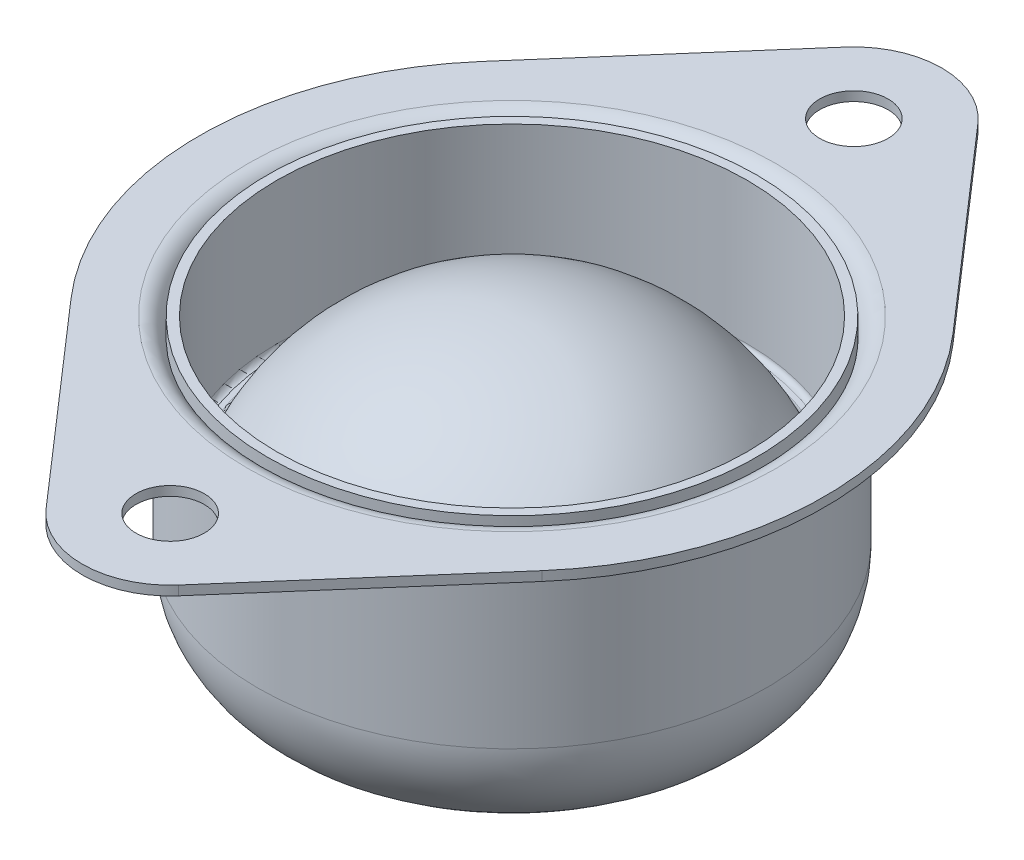
ISO-10303-21;
HEADER;
FILE_DESCRIPTION(('STEP AP214'),'2;1');
FILE_NAME('part.step','',(''),(''),'','','');
FILE_SCHEMA(('AUTOMOTIVE_DESIGN { 1 0 10303 214 1 1 1 1 }'));
ENDSEC;
DATA;
#1=APPLICATION_CONTEXT('core data for automotive mechanical design processes');
#2=APPLICATION_PROTOCOL_DEFINITION('international standard','automotive_design',2000,#1);
#3=PRODUCT_CONTEXT('',#1,'mechanical');
#4=PRODUCT('Part','Part','',(#3));
#5=PRODUCT_RELATED_PRODUCT_CATEGORY('part','',(#4));
#6=PRODUCT_DEFINITION_FORMATION('','',#4);
#7=PRODUCT_DEFINITION_CONTEXT('part definition',#1,'design');
#8=PRODUCT_DEFINITION('design','',#6,#7);
#9=PRODUCT_DEFINITION_SHAPE('','',#8);
#10=(LENGTH_UNIT() NAMED_UNIT(*) SI_UNIT(.MILLI.,.METRE.));
#11=(NAMED_UNIT(*) PLANE_ANGLE_UNIT() SI_UNIT($,.RADIAN.));
#12=(NAMED_UNIT(*) SI_UNIT($,.STERADIAN.) SOLID_ANGLE_UNIT());
#13=UNCERTAINTY_MEASURE_WITH_UNIT(LENGTH_MEASURE(1.E-05),#10,'distance_accuracy_value','');
#14=(GEOMETRIC_REPRESENTATION_CONTEXT(3) GLOBAL_UNCERTAINTY_ASSIGNED_CONTEXT((#13)) GLOBAL_UNIT_ASSIGNED_CONTEXT((#10,
#11,#12)) REPRESENTATION_CONTEXT('',''));
#15=CARTESIAN_POINT('',(0.,0.,0.));
#16=DIRECTION('',(0.,0.,1.));
#17=DIRECTION('',(1.,0.,0.));
#18=AXIS2_PLACEMENT_3D('',#15,#16,#17);
#19=CARTESIAN_POINT('',(0.,-16.7005,0.));
#20=DIRECTION('',(0.,-1.,0.));
#21=DIRECTION('',(0.,0.,1.));
#22=AXIS2_PLACEMENT_3D('',#19,#20,#21);
#23=SPHERICAL_SURFACE('',#22,12.7);
#24=CARTESIAN_POINT('',(0.,-29.4005,0.));
#25=VERTEX_POINT('',#24);
#26=VERTEX_LOOP('',#25);
#27=FACE_BOUND('',#26,.T.);
#28=ADVANCED_FACE('F39',(#27),#23,.T.);
#29=CLOSED_SHELL('',(#28));
#30=MANIFOLD_SOLID_BREP('B2',#29);
#31=CARTESIAN_POINT('',(0.,-11.938,0.));
#32=DIRECTION('',(0.,1.,0.));
#33=DIRECTION('',(0.,0.,1.));
#34=AXIS2_PLACEMENT_3D('',#31,#32,#33);
#35=CYLINDRICAL_SURFACE('',#34,19.8755);
#36=CARTESIAN_POINT('',(0.,-10.747375,0.));
#37=DIRECTION('',(0.,1.,0.));
#38=DIRECTION('',(0.,0.,1.));
#39=AXIS2_PLACEMENT_3D('',#36,#37,#38);
#40=CIRCLE('',#39,19.8755);
#41=CARTESIAN_POINT('',(0.,-10.747375,19.8755));
#42=VERTEX_POINT('',#41);
#43=EDGE_CURVE('E76',#42,#42,#40,.T.);
#44=ORIENTED_EDGE('',*,*,#43,.T.);
#45=EDGE_LOOP('',(#44));
#46=FACE_BOUND('',#45,.T.);
#47=CARTESIAN_POINT('',(0.,0.762,0.));
#48=DIRECTION('',(0.,1.,0.));
#49=DIRECTION('',(0.,0.,1.));
#50=AXIS2_PLACEMENT_3D('',#47,#48,#49);
#51=CIRCLE('',#50,19.8755);
#52=CARTESIAN_POINT('',(0.,0.762,19.8755));
#53=VERTEX_POINT('',#52);
#54=EDGE_CURVE('E81',#53,#53,#51,.T.);
#55=ORIENTED_EDGE('',*,*,#54,.F.);
#56=EDGE_LOOP('',(#55));
#57=FACE_BOUND('',#56,.T.);
#58=ADVANCED_FACE('F61',(#46,#57),#35,.T.);
#59=CARTESIAN_POINT('',(0.,-11.938,0.));
#60=DIRECTION('',(0.,1.,0.));
#61=DIRECTION('',(0.,0.,1.));
#62=AXIS2_PLACEMENT_3D('',#59,#60,#61);
#63=PLANE('',#62);
#64=CARTESIAN_POINT('',(0.,-11.938,0.));
#65=DIRECTION('',(0.,1.,0.));
#66=DIRECTION('',(0.,0.,1.));
#67=AXIS2_PLACEMENT_3D('',#64,#65,#66);
#68=CIRCLE('',#67,18.684875);
#69=CARTESIAN_POINT('',(0.,-11.938,18.684875));
#70=VERTEX_POINT('',#69);
#71=EDGE_CURVE('E68',#70,#70,#68,.F.);
#72=ORIENTED_EDGE('',*,*,#71,.T.);
#73=EDGE_LOOP('',(#72));
#74=FACE_BOUND('',#73,.T.);
#75=CARTESIAN_POINT('',(0.,-11.938,0.));
#76=DIRECTION('',(0.,1.,0.));
#77=DIRECTION('',(0.,0.,1.));
#78=AXIS2_PLACEMENT_3D('',#75,#76,#77);
#79=CIRCLE('',#78,18.2583205347589);
#80=CARTESIAN_POINT('',(0.,-11.938,18.2583205347589));
#81=VERTEX_POINT('',#80);
#82=EDGE_CURVE('E72',#81,#81,#79,.T.);
#83=ORIENTED_EDGE('',*,*,#82,.T.);
#84=EDGE_LOOP('',(#83));
#85=FACE_BOUND('',#84,.T.);
#86=ADVANCED_FACE('F113',(#74,#85),#63,.F.);
#87=CARTESIAN_POINT('',(0.,0.762,0.));
#88=DIRECTION('',(0.,1.,0.));
#89=DIRECTION('',(0.,0.,1.));
#90=AXIS2_PLACEMENT_3D('',#87,#88,#89);
#91=PLANE('',#90);
#92=CARTESIAN_POINT('',(0.,0.762000000000001,0.));
#93=DIRECTION('',(0.,1.,0.));
#94=DIRECTION('',(0.,0.,1.));
#95=AXIS2_PLACEMENT_3D('',#92,#93,#94);
#96=CIRCLE('',#95,19.1135);
#97=CARTESIAN_POINT('',(0.,0.762000000000001,19.1135));
#98=VERTEX_POINT('',#97);
#99=EDGE_CURVE('E85',#98,#98,#96,.T.);
#100=ORIENTED_EDGE('',*,*,#99,.F.);
#101=EDGE_LOOP('',(#100));
#102=FACE_BOUND('',#101,.T.);
#103=ORIENTED_EDGE('',*,*,#54,.T.);
#104=EDGE_LOOP('',(#103));
#105=FACE_BOUND('',#104,.T.);
#106=ADVANCED_FACE('F109',(#102,#105),#91,.T.);
#107=CARTESIAN_POINT('',(0.,-18.7407752659574,0.));
#108=DIRECTION('',(0.,-1.,0.));
#109=DIRECTION('',(0.,0.,1.));
#110=AXIS2_PLACEMENT_3D('',#107,#108,#109);
#111=SPHERICAL_SURFACE('',#110,18.7407752659574);
#112=CARTESIAN_POINT('',(0.,-11.2248699107771,0.));
#113=DIRECTION('',(0.,-1.,0.));
#114=DIRECTION('',(0.,0.,-1.));
#115=AXIS2_PLACEMENT_3D('',#112,#113,#114);
#116=CIRCLE('',#115,17.1676388668067);
#117=CARTESIAN_POINT('',(0.,-11.2248699107771,-17.1676388668067));
#118=VERTEX_POINT('',#117);
#119=EDGE_CURVE('E38',#118,#118,#116,.T.);
#120=ORIENTED_EDGE('',*,*,#119,.T.);
#121=EDGE_LOOP('',(#120));
#122=FACE_BOUND('',#121,.T.);
#123=ADVANCED_FACE('F112',(#122),#111,.F.);
#124=CARTESIAN_POINT('',(0.,-10.747375,0.));
#125=DIRECTION('',(0.,1.,0.));
#126=DIRECTION('',(0.,0.,1.));
#127=AXIS2_PLACEMENT_3D('',#124,#125,#126);
#128=TOROIDAL_SURFACE('',#127,18.684875,1.190625);
#129=ORIENTED_EDGE('',*,*,#71,.F.);
#130=EDGE_LOOP('',(#129));
#131=FACE_BOUND('',#130,.T.);
#132=ORIENTED_EDGE('',*,*,#43,.F.);
#133=EDGE_LOOP('',(#132));
#134=FACE_BOUND('',#133,.T.);
#135=ADVANCED_FACE('F124',(#131,#134),#128,.T.);
#136=CARTESIAN_POINT('',(0.,-10.747375,0.));
#137=DIRECTION('',(0.,1.,0.));
#138=DIRECTION('',(0.,0.,1.));
#139=AXIS2_PLACEMENT_3D('',#136,#137,#138);
#140=TOROIDAL_SURFACE('',#139,18.2583205347589,1.190625);
#141=ORIENTED_EDGE('',*,*,#82,.F.);
#142=EDGE_LOOP('',(#141));
#143=FACE_BOUND('',#142,.T.);
#144=ORIENTED_EDGE('',*,*,#119,.F.);
#145=EDGE_LOOP('',(#144));
#146=FACE_BOUND('',#145,.T.);
#147=ADVANCED_FACE('F63',(#143,#146),#140,.T.);
#148=CARTESIAN_POINT('',(0.,-11.938,0.));
#149=DIRECTION('',(0.,1.,0.));
#150=DIRECTION('',(0.,0.,1.));
#151=AXIS2_PLACEMENT_3D('',#148,#149,#150);
#152=CYLINDRICAL_SURFACE('',#151,19.1135);
#153=CARTESIAN_POINT('',(0.,-10.747375,0.));
#154=DIRECTION('',(0.,1.,0.));
#155=DIRECTION('',(0.,0.,1.));
#156=AXIS2_PLACEMENT_3D('',#153,#154,#155);
#157=CIRCLE('',#156,19.1135);
#158=CARTESIAN_POINT('',(0.,-10.747375,19.1135));
#159=VERTEX_POINT('',#158);
#160=EDGE_CURVE('E88',#159,#159,#157,.T.);
#161=ORIENTED_EDGE('',*,*,#160,.F.);
#162=EDGE_LOOP('',(#161));
#163=FACE_BOUND('',#162,.T.);
#164=ORIENTED_EDGE('',*,*,#99,.T.);
#165=EDGE_LOOP('',(#164));
#166=FACE_BOUND('',#165,.T.);
#167=ADVANCED_FACE('F102',(#163,#166),#152,.F.);
#168=CARTESIAN_POINT('',(0.,-11.176,0.));
#169=DIRECTION('',(0.,1.,0.));
#170=DIRECTION('',(0.,0.,1.));
#171=AXIS2_PLACEMENT_3D('',#168,#169,#170);
#172=PLANE('',#171);
#173=CARTESIAN_POINT('',(0.,-11.176,0.));
#174=DIRECTION('',(0.,1.,0.));
#175=DIRECTION('',(0.,0.,1.));
#176=AXIS2_PLACEMENT_3D('',#173,#174,#175);
#177=CIRCLE('',#176,18.684875);
#178=CARTESIAN_POINT('',(0.,-11.176,18.684875));
#179=VERTEX_POINT('',#178);
#180=EDGE_CURVE('E91',#179,#179,#177,.F.);
#181=ORIENTED_EDGE('',*,*,#180,.F.);
#182=EDGE_LOOP('',(#181));
#183=FACE_BOUND('',#182,.T.);
#184=CARTESIAN_POINT('',(0.,-11.176,0.));
#185=DIRECTION('',(0.,1.,0.));
#186=DIRECTION('',(0.,0.,1.));
#187=AXIS2_PLACEMENT_3D('',#184,#185,#186);
#188=CIRCLE('',#187,18.2583205347589);
#189=CARTESIAN_POINT('',(0.,-11.176,18.2583205347589));
#190=VERTEX_POINT('',#189);
#191=EDGE_CURVE('E92',#190,#190,#188,.T.);
#192=ORIENTED_EDGE('',*,*,#191,.F.);
#193=EDGE_LOOP('',(#192));
#194=FACE_BOUND('',#193,.T.);
#195=ADVANCED_FACE('F105',(#183,#194),#172,.T.);
#196=CARTESIAN_POINT('',(0.,-18.7407752659574,0.));
#197=DIRECTION('',(0.,-1.,0.));
#198=DIRECTION('',(0.,0.,1.));
#199=AXIS2_PLACEMENT_3D('',#196,#197,#198);
#200=SPHERICAL_SURFACE('',#199,19.5027752659574);
#201=CARTESIAN_POINT('',(0.,-10.9192731678797,0.));
#202=DIRECTION('',(0.,-1.,0.));
#203=DIRECTION('',(0.,0.,-1.));
#204=AXIS2_PLACEMENT_3D('',#201,#202,#203);
#205=CIRCLE('',#204,17.8656751342961);
#206=CARTESIAN_POINT('',(0.,-10.9192731678797,-17.8656751342961));
#207=VERTEX_POINT('',#206);
#208=EDGE_CURVE('E84',#207,#207,#205,.T.);
#209=ORIENTED_EDGE('',*,*,#208,.F.);
#210=EDGE_LOOP('',(#209));
#211=FACE_BOUND('',#210,.T.);
#212=ADVANCED_FACE('F144',(#211),#200,.T.);
#213=CARTESIAN_POINT('',(0.,-10.747375,0.));
#214=DIRECTION('',(0.,1.,0.));
#215=DIRECTION('',(0.,0.,1.));
#216=AXIS2_PLACEMENT_3D('',#213,#214,#215);
#217=TOROIDAL_SURFACE('',#216,18.684875,0.428625);
#218=ORIENTED_EDGE('',*,*,#180,.T.);
#219=EDGE_LOOP('',(#218));
#220=FACE_BOUND('',#219,.T.);
#221=ORIENTED_EDGE('',*,*,#160,.T.);
#222=EDGE_LOOP('',(#221));
#223=FACE_BOUND('',#222,.T.);
#224=ADVANCED_FACE('F100',(#220,#223),#217,.F.);
#225=CARTESIAN_POINT('',(0.,-10.747375,0.));
#226=DIRECTION('',(0.,1.,0.));
#227=DIRECTION('',(0.,0.,1.));
#228=AXIS2_PLACEMENT_3D('',#225,#226,#227);
#229=TOROIDAL_SURFACE('',#228,18.2583205347589,0.428625);
#230=ORIENTED_EDGE('',*,*,#191,.T.);
#231=EDGE_LOOP('',(#230));
#232=FACE_BOUND('',#231,.T.);
#233=ORIENTED_EDGE('',*,*,#208,.T.);
#234=EDGE_LOOP('',(#233));
#235=FACE_BOUND('',#234,.T.);
#236=ADVANCED_FACE('F138',(#232,#235),#229,.F.);
#237=CLOSED_SHELL('',(#58,#86,#106,#123,#135,#147,#167,#195,#212,#224,#236));
#238=MANIFOLD_SOLID_BREP('B6',#237);
#239=CARTESIAN_POINT('',(0.,0.762,0.));
#240=DIRECTION('',(0.,1.,0.));
#241=DIRECTION('',(0.,0.,1.));
#242=AXIS2_PLACEMENT_3D('',#239,#240,#241);
#243=PLANE('',#242);
#244=CARTESIAN_POINT('',(0.,0.762,0.));
#245=DIRECTION('',(0.,1.,0.));
#246=DIRECTION('',(0.,0.,1.));
#247=AXIS2_PLACEMENT_3D('',#244,#245,#246);
#248=CIRCLE('',#247,21.463);
#249=CARTESIAN_POINT('',(0.,0.762,21.463));
#250=VERTEX_POINT('',#249);
#251=EDGE_CURVE('E231',#250,#250,#248,.F.);
#252=ORIENTED_EDGE('',*,*,#251,.T.);
#253=EDGE_LOOP('',(#252));
#254=FACE_BOUND('',#253,.T.);
#255=CARTESIAN_POINT('',(0.,0.762,-27.78125));
#256=DIRECTION('',(0.,1.,0.));
#257=DIRECTION('',(0.,0.,1.));
#258=AXIS2_PLACEMENT_3D('',#255,#256,#257);
#259=CIRCLE('',#258,2.778125);
#260=CARTESIAN_POINT('',(0.,0.762,-30.559375));
#261=VERTEX_POINT('',#260);
#262=EDGE_CURVE('E324',#261,#261,#259,.T.);
#263=ORIENTED_EDGE('',*,*,#262,.F.);
#264=EDGE_LOOP('',(#263));
#265=FACE_BOUND('',#264,.T.);
#266=CARTESIAN_POINT('',(0.,0.762,0.));
#267=DIRECTION('',(0.,1.,0.));
#268=DIRECTION('',(0.,0.,1.));
#269=AXIS2_PLACEMENT_3D('',#266,#267,#268);
#270=CIRCLE('',#269,25.4);
#271=CARTESIAN_POINT('',(19.1456577908647,0.762,16.6914285714286));
#272=VERTEX_POINT('',#271);
#273=CARTESIAN_POINT('',(19.1456577908647,0.762,-16.6914285714286));
#274=VERTEX_POINT('',#273);
#275=EDGE_CURVE('E335',#272,#274,#270,.T.);
#276=ORIENTED_EDGE('',*,*,#275,.T.);
#277=DIRECTION('',(-0.657142857142857,0.,-0.753766054758452));
#278=VECTOR('',#277,1.);
#279=CARTESIAN_POINT('',(19.1456577908647,0.762,-16.6914285714286));
#280=LINE('',#279,#278);
#281=CARTESIAN_POINT('',(5.38471625368068,0.762,-32.4757142857143));
#282=VERTEX_POINT('',#281);
#283=EDGE_CURVE('E283',#274,#282,#280,.T.);
#284=ORIENTED_EDGE('',*,*,#283,.T.);
#285=CARTESIAN_POINT('',(0.,0.762,-27.78125));
#286=DIRECTION('',(0.,1.,0.));
#287=DIRECTION('',(0.,0.,1.));
#288=AXIS2_PLACEMENT_3D('',#285,#286,#287);
#289=CIRCLE('',#288,7.14374999999999);
#290=CARTESIAN_POINT('',(-5.38471625368071,0.762,-32.4757142857143));
#291=VERTEX_POINT('',#290);
#292=EDGE_CURVE('E455',#282,#291,#289,.T.);
#293=ORIENTED_EDGE('',*,*,#292,.T.);
#294=DIRECTION('',(-0.657142857142857,0.,0.753766054758452));
#295=VECTOR('',#294,1.);
#296=CARTESIAN_POINT('',(-5.38471625368071,0.762,-32.4757142857143));
#297=LINE('',#296,#295);
#298=CARTESIAN_POINT('',(-19.1456577908647,0.762,-16.6914285714286));
#299=VERTEX_POINT('',#298);
#300=EDGE_CURVE('E457',#291,#299,#297,.T.);
#301=ORIENTED_EDGE('',*,*,#300,.T.);
#302=CARTESIAN_POINT('',(0.,0.762,0.));
#303=DIRECTION('',(0.,1.,0.));
#304=DIRECTION('',(0.,0.,1.));
#305=AXIS2_PLACEMENT_3D('',#302,#303,#304);
#306=CIRCLE('',#305,25.4);
#307=CARTESIAN_POINT('',(-19.1456577908647,0.762,16.6914285714286));
#308=VERTEX_POINT('',#307);
#309=EDGE_CURVE('E302',#299,#308,#306,.T.);
#310=ORIENTED_EDGE('',*,*,#309,.T.);
#311=DIRECTION('',(0.657142857142857,0.,0.753766054758453));
#312=VECTOR('',#311,1.);
#313=CARTESIAN_POINT('',(-5.38471625368069,0.762,32.4757142857143));
#314=LINE('',#313,#312);
#315=CARTESIAN_POINT('',(-5.38471625368069,0.762,32.4757142857143));
#316=VERTEX_POINT('',#315);
#317=EDGE_CURVE('E296',#308,#316,#314,.T.);
#318=ORIENTED_EDGE('',*,*,#317,.T.);
#319=CARTESIAN_POINT('',(0.,0.762,27.78125));
#320=DIRECTION('',(0.,1.,0.));
#321=DIRECTION('',(0.,0.,1.));
#322=AXIS2_PLACEMENT_3D('',#319,#320,#321);
#323=CIRCLE('',#322,7.14375);
#324=CARTESIAN_POINT('',(5.38471625368069,0.762,32.4757142857143));
#325=VERTEX_POINT('',#324);
#326=EDGE_CURVE('E300',#316,#325,#323,.T.);
#327=ORIENTED_EDGE('',*,*,#326,.T.);
#328=DIRECTION('',(0.657142857142857,0.,-0.753766054758452));
#329=VECTOR('',#328,1.);
#330=CARTESIAN_POINT('',(19.1456577908647,0.762,16.6914285714286));
#331=LINE('',#330,#329);
#332=EDGE_CURVE('E239',#325,#272,#331,.T.);
#333=ORIENTED_EDGE('',*,*,#332,.T.);
#334=EDGE_LOOP('',(#276,#284,#293,#301,#310,#318,#327,#333));
#335=FACE_BOUND('',#334,.T.);
#336=CARTESIAN_POINT('',(0.,0.762,27.78125));
#337=DIRECTION('',(0.,1.,0.));
#338=DIRECTION('',(0.,0.,1.));
#339=AXIS2_PLACEMENT_3D('',#336,#337,#338);
#340=CIRCLE('',#339,2.778125);
#341=CARTESIAN_POINT('',(0.,0.762,25.003125));
#342=VERTEX_POINT('',#341);
#343=EDGE_CURVE('E443',#342,#342,#340,.T.);
#344=ORIENTED_EDGE('',*,*,#343,.F.);
#345=EDGE_LOOP('',(#344));
#346=FACE_BOUND('',#345,.T.);
#347=ADVANCED_FACE('F222',(#254,#265,#335,#346),#243,.T.);
#348=CARTESIAN_POINT('',(0.,0.,0.));
#349=DIRECTION('',(0.,1.,0.));
#350=DIRECTION('',(0.,0.,1.));
#351=AXIS2_PLACEMENT_3D('',#348,#349,#350);
#352=PLANE('',#351);
#353=CARTESIAN_POINT('',(0.,0.,0.));
#354=DIRECTION('',(0.,1.,0.));
#355=DIRECTION('',(0.,0.,1.));
#356=AXIS2_PLACEMENT_3D('',#353,#354,#355);
#357=CIRCLE('',#356,22.225);
#358=CARTESIAN_POINT('',(0.,0.,22.225));
#359=VERTEX_POINT('',#358);
#360=EDGE_CURVE('E356',#359,#359,#357,.T.);
#361=ORIENTED_EDGE('',*,*,#360,.T.);
#362=EDGE_LOOP('',(#361));
#363=FACE_BOUND('',#362,.T.);
#364=CARTESIAN_POINT('',(0.,0.,0.));
#365=DIRECTION('',(0.,1.,0.));
#366=DIRECTION('',(0.,0.,1.));
#367=AXIS2_PLACEMENT_3D('',#364,#365,#366);
#368=CIRCLE('',#367,25.4);
#369=CARTESIAN_POINT('',(19.1456577908647,0.,16.6914285714286));
#370=VERTEX_POINT('',#369);
#371=CARTESIAN_POINT('',(19.1456577908647,0.,-16.6914285714286));
#372=VERTEX_POINT('',#371);
#373=EDGE_CURVE('E320',#370,#372,#368,.T.);
#374=ORIENTED_EDGE('',*,*,#373,.F.);
#375=DIRECTION('',(0.657142857142857,0.,-0.753766054758452));
#376=VECTOR('',#375,1.);
#377=CARTESIAN_POINT('',(19.1456577908647,0.,16.6914285714286));
#378=LINE('',#377,#376);
#379=CARTESIAN_POINT('',(5.38471625368069,0.,32.4757142857143));
#380=VERTEX_POINT('',#379);
#381=EDGE_CURVE('E274',#380,#370,#378,.T.);
#382=ORIENTED_EDGE('',*,*,#381,.F.);
#383=CARTESIAN_POINT('',(0.,0.,27.78125));
#384=DIRECTION('',(0.,1.,0.));
#385=DIRECTION('',(0.,0.,1.));
#386=AXIS2_PLACEMENT_3D('',#383,#384,#385);
#387=CIRCLE('',#386,7.14375);
#388=CARTESIAN_POINT('',(-5.38471625368069,0.,32.4757142857143));
#389=VERTEX_POINT('',#388);
#390=EDGE_CURVE('E268',#389,#380,#387,.T.);
#391=ORIENTED_EDGE('',*,*,#390,.F.);
#392=DIRECTION('',(0.657142857142857,0.,0.753766054758453));
#393=VECTOR('',#392,1.);
#394=CARTESIAN_POINT('',(-5.38471625368069,0.,32.4757142857143));
#395=LINE('',#394,#393);
#396=CARTESIAN_POINT('',(-19.1456577908647,0.,16.6914285714286));
#397=VERTEX_POINT('',#396);
#398=EDGE_CURVE('E310',#397,#389,#395,.T.);
#399=ORIENTED_EDGE('',*,*,#398,.F.);
#400=CARTESIAN_POINT('',(0.,0.,0.));
#401=DIRECTION('',(0.,1.,0.));
#402=DIRECTION('',(0.,0.,1.));
#403=AXIS2_PLACEMENT_3D('',#400,#401,#402);
#404=CIRCLE('',#403,25.4);
#405=CARTESIAN_POINT('',(-19.1456577908647,0.,-16.6914285714286));
#406=VERTEX_POINT('',#405);
#407=EDGE_CURVE('E330',#406,#397,#404,.T.);
#408=ORIENTED_EDGE('',*,*,#407,.F.);
#409=DIRECTION('',(-0.657142857142857,0.,0.753766054758452));
#410=VECTOR('',#409,1.);
#411=CARTESIAN_POINT('',(-5.38471625368071,0.,-32.4757142857143));
#412=LINE('',#411,#410);
#413=CARTESIAN_POINT('',(-5.38471625368071,0.,-32.4757142857143));
#414=VERTEX_POINT('',#413);
#415=EDGE_CURVE('E328',#414,#406,#412,.T.);
#416=ORIENTED_EDGE('',*,*,#415,.F.);
#417=CARTESIAN_POINT('',(0.,0.,-27.78125));
#418=DIRECTION('',(0.,1.,0.));
#419=DIRECTION('',(0.,0.,1.));
#420=AXIS2_PLACEMENT_3D('',#417,#418,#419);
#421=CIRCLE('',#420,7.14374999999999);
#422=CARTESIAN_POINT('',(5.38471625368068,0.,-32.4757142857143));
#423=VERTEX_POINT('',#422);
#424=EDGE_CURVE('E326',#423,#414,#421,.T.);
#425=ORIENTED_EDGE('',*,*,#424,.F.);
#426=DIRECTION('',(-0.657142857142857,0.,-0.753766054758452));
#427=VECTOR('',#426,1.);
#428=CARTESIAN_POINT('',(19.1456577908647,0.,-16.6914285714286));
#429=LINE('',#428,#427);
#430=EDGE_CURVE('E323',#372,#423,#429,.T.);
#431=ORIENTED_EDGE('',*,*,#430,.F.);
#432=EDGE_LOOP('',(#374,#382,#391,#399,#408,#416,#425,#431));
#433=FACE_BOUND('',#432,.T.);
#434=CARTESIAN_POINT('',(0.,0.,-27.78125));
#435=DIRECTION('',(0.,1.,0.));
#436=DIRECTION('',(0.,0.,1.));
#437=AXIS2_PLACEMENT_3D('',#434,#435,#436);
#438=CIRCLE('',#437,2.778125);
#439=CARTESIAN_POINT('',(0.,0.,-30.559375));
#440=VERTEX_POINT('',#439);
#441=EDGE_CURVE('E446',#440,#440,#438,.T.);
#442=ORIENTED_EDGE('',*,*,#441,.T.);
#443=EDGE_LOOP('',(#442));
#444=FACE_BOUND('',#443,.T.);
#445=CARTESIAN_POINT('',(0.,0.,27.78125));
#446=DIRECTION('',(0.,1.,0.));
#447=DIRECTION('',(0.,0.,1.));
#448=AXIS2_PLACEMENT_3D('',#445,#446,#447);
#449=CIRCLE('',#448,2.778125);
#450=CARTESIAN_POINT('',(0.,0.,25.003125));
#451=VERTEX_POINT('',#450);
#452=EDGE_CURVE('E442',#451,#451,#449,.T.);
#453=ORIENTED_EDGE('',*,*,#452,.T.);
#454=EDGE_LOOP('',(#453));
#455=FACE_BOUND('',#454,.T.);
#456=ADVANCED_FACE('F377',(#363,#433,#444,#455),#352,.F.);
#457=CARTESIAN_POINT('',(0.,0.762,0.));
#458=DIRECTION('',(0.,-1.,0.));
#459=DIRECTION('',(0.,0.,-1.));
#460=AXIS2_PLACEMENT_3D('',#457,#458,#459);
#461=CYLINDRICAL_SURFACE('',#460,25.4);
#462=ORIENTED_EDGE('',*,*,#373,.T.);
#463=DIRECTION('',(0.,-1.,0.));
#464=VECTOR('',#463,1.);
#465=CARTESIAN_POINT('',(19.1456577908647,0.762,-16.6914285714286));
#466=LINE('',#465,#464);
#467=EDGE_CURVE('E348',#274,#372,#466,.T.);
#468=ORIENTED_EDGE('',*,*,#467,.F.);
#469=ORIENTED_EDGE('',*,*,#275,.F.);
#470=DIRECTION('',(0.,-1.,0.));
#471=VECTOR('',#470,1.);
#472=CARTESIAN_POINT('',(19.1456577908647,0.762,16.6914285714286));
#473=LINE('',#472,#471);
#474=EDGE_CURVE('E316',#272,#370,#473,.T.);
#475=ORIENTED_EDGE('',*,*,#474,.T.);
#476=EDGE_LOOP('',(#462,#468,#469,#475));
#477=FACE_BOUND('',#476,.T.);
#478=ADVANCED_FACE('F382',(#477),#461,.T.);
#479=CARTESIAN_POINT('',(19.1456577908647,0.762,-16.6914285714286));
#480=DIRECTION('',(-0.753766054758452,0.,0.657142857142857));
#481=DIRECTION('',(0.657142857142857,0.,0.753766054758452));
#482=AXIS2_PLACEMENT_3D('',#479,#480,#481);
#483=PLANE('',#482);
#484=ORIENTED_EDGE('',*,*,#430,.T.);
#485=DIRECTION('',(0.,-1.,0.));
#486=VECTOR('',#485,1.);
#487=CARTESIAN_POINT('',(5.38471625368068,0.762,-32.4757142857143));
#488=LINE('',#487,#486);
#489=EDGE_CURVE('E345',#282,#423,#488,.T.);
#490=ORIENTED_EDGE('',*,*,#489,.F.);
#491=ORIENTED_EDGE('',*,*,#283,.F.);
#492=ORIENTED_EDGE('',*,*,#467,.T.);
#493=EDGE_LOOP('',(#484,#490,#491,#492));
#494=FACE_BOUND('',#493,.T.);
#495=ADVANCED_FACE('F407',(#494),#483,.F.);
#496=CARTESIAN_POINT('',(0.,0.762,-27.78125));
#497=DIRECTION('',(0.,-1.,0.));
#498=DIRECTION('',(0.,0.,-1.));
#499=AXIS2_PLACEMENT_3D('',#496,#497,#498);
#500=CYLINDRICAL_SURFACE('',#499,7.14374999999999);
#501=ORIENTED_EDGE('',*,*,#424,.T.);
#502=DIRECTION('',(0.,-1.,0.));
#503=VECTOR('',#502,1.);
#504=CARTESIAN_POINT('',(-5.38471625368071,0.762,-32.4757142857143));
#505=LINE('',#504,#503);
#506=EDGE_CURVE('E342',#291,#414,#505,.T.);
#507=ORIENTED_EDGE('',*,*,#506,.F.);
#508=ORIENTED_EDGE('',*,*,#292,.F.);
#509=ORIENTED_EDGE('',*,*,#489,.T.);
#510=EDGE_LOOP('',(#501,#507,#508,#509));
#511=FACE_BOUND('',#510,.T.);
#512=ADVANCED_FACE('F403',(#511),#500,.T.);
#513=CARTESIAN_POINT('',(-5.38471625368071,0.762,-32.4757142857143));
#514=DIRECTION('',(0.753766054758452,0.,0.657142857142857));
#515=DIRECTION('',(0.657142857142857,0.,-0.753766054758452));
#516=AXIS2_PLACEMENT_3D('',#513,#514,#515);
#517=PLANE('',#516);
#518=ORIENTED_EDGE('',*,*,#415,.T.);
#519=DIRECTION('',(0.,-1.,0.));
#520=VECTOR('',#519,1.);
#521=CARTESIAN_POINT('',(-19.1456577908647,0.762,-16.6914285714286));
#522=LINE('',#521,#520);
#523=EDGE_CURVE('E339',#299,#406,#522,.T.);
#524=ORIENTED_EDGE('',*,*,#523,.F.);
#525=ORIENTED_EDGE('',*,*,#300,.F.);
#526=ORIENTED_EDGE('',*,*,#506,.T.);
#527=EDGE_LOOP('',(#518,#524,#525,#526));
#528=FACE_BOUND('',#527,.T.);
#529=ADVANCED_FACE('F399',(#528),#517,.F.);
#530=CARTESIAN_POINT('',(0.,0.762,0.));
#531=DIRECTION('',(0.,-1.,0.));
#532=DIRECTION('',(0.,0.,-1.));
#533=AXIS2_PLACEMENT_3D('',#530,#531,#532);
#534=CYLINDRICAL_SURFACE('',#533,25.4);
#535=ORIENTED_EDGE('',*,*,#407,.T.);
#536=DIRECTION('',(0.,-1.,0.));
#537=VECTOR('',#536,1.);
#538=CARTESIAN_POINT('',(-19.1456577908647,0.762,16.6914285714286));
#539=LINE('',#538,#537);
#540=EDGE_CURVE('E311',#308,#397,#539,.T.);
#541=ORIENTED_EDGE('',*,*,#540,.F.);
#542=ORIENTED_EDGE('',*,*,#309,.F.);
#543=ORIENTED_EDGE('',*,*,#523,.T.);
#544=EDGE_LOOP('',(#535,#541,#542,#543));
#545=FACE_BOUND('',#544,.T.);
#546=ADVANCED_FACE('F396',(#545),#534,.T.);
#547=CARTESIAN_POINT('',(-5.38471625368069,0.762,32.4757142857143));
#548=DIRECTION('',(0.753766054758452,0.,-0.657142857142857));
#549=DIRECTION('',(-0.657142857142857,0.,-0.753766054758453));
#550=AXIS2_PLACEMENT_3D('',#547,#548,#549);
#551=PLANE('',#550);
#552=ORIENTED_EDGE('',*,*,#398,.T.);
#553=DIRECTION('',(0.,-1.,0.));
#554=VECTOR('',#553,1.);
#555=CARTESIAN_POINT('',(-5.38471625368069,0.762,32.4757142857143));
#556=LINE('',#555,#554);
#557=EDGE_CURVE('E307',#316,#389,#556,.T.);
#558=ORIENTED_EDGE('',*,*,#557,.F.);
#559=ORIENTED_EDGE('',*,*,#317,.F.);
#560=ORIENTED_EDGE('',*,*,#540,.T.);
#561=EDGE_LOOP('',(#552,#558,#559,#560));
#562=FACE_BOUND('',#561,.T.);
#563=ADVANCED_FACE('F308',(#562),#551,.F.);
#564=CARTESIAN_POINT('',(0.,0.762,27.78125));
#565=DIRECTION('',(0.,-1.,0.));
#566=DIRECTION('',(0.,0.,-1.));
#567=AXIS2_PLACEMENT_3D('',#564,#565,#566);
#568=CYLINDRICAL_SURFACE('',#567,7.14375);
#569=ORIENTED_EDGE('',*,*,#390,.T.);
#570=DIRECTION('',(0.,-1.,0.));
#571=VECTOR('',#570,1.);
#572=CARTESIAN_POINT('',(5.38471625368069,0.762,32.4757142857143));
#573=LINE('',#572,#571);
#574=EDGE_CURVE('E312',#325,#380,#573,.T.);
#575=ORIENTED_EDGE('',*,*,#574,.F.);
#576=ORIENTED_EDGE('',*,*,#326,.F.);
#577=ORIENTED_EDGE('',*,*,#557,.T.);
#578=EDGE_LOOP('',(#569,#575,#576,#577));
#579=FACE_BOUND('',#578,.T.);
#580=ADVANCED_FACE('F314',(#579),#568,.T.);
#581=CARTESIAN_POINT('',(19.1456577908647,0.762,16.6914285714286));
#582=DIRECTION('',(-0.753766054758452,0.,-0.657142857142857));
#583=DIRECTION('',(-0.657142857142857,0.,0.753766054758453));
#584=AXIS2_PLACEMENT_3D('',#581,#582,#583);
#585=PLANE('',#584);
#586=ORIENTED_EDGE('',*,*,#381,.T.);
#587=ORIENTED_EDGE('',*,*,#474,.F.);
#588=ORIENTED_EDGE('',*,*,#332,.F.);
#589=ORIENTED_EDGE('',*,*,#574,.T.);
#590=EDGE_LOOP('',(#586,#587,#588,#589));
#591=FACE_BOUND('',#590,.T.);
#592=ADVANCED_FACE('F389',(#591),#585,.F.);
#593=CARTESIAN_POINT('',(0.,0.762,-27.78125));
#594=DIRECTION('',(0.,-1.,0.));
#595=DIRECTION('',(0.,0.,-1.));
#596=AXIS2_PLACEMENT_3D('',#593,#594,#595);
#597=CYLINDRICAL_SURFACE('',#596,2.778125);
#598=CARTESIAN_POINT('',(0.,0.762,-30.559375));
#599=CARTESIAN_POINT('',(0.,0.7540625,-30.559375));
#600=CARTESIAN_POINT('',(0.,0.746125,-30.559375));
#601=CARTESIAN_POINT('',(0.,0.73025,-30.559375));
#602=CARTESIAN_POINT('',(0.,0.7223125,-30.559375));
#603=CARTESIAN_POINT('',(0.,0.7064375,-30.559375));
#604=CARTESIAN_POINT('',(0.,0.6985,-30.559375));
#605=CARTESIAN_POINT('',(0.,0.682625,-30.559375));
#606=CARTESIAN_POINT('',(0.,0.6746875,-30.559375));
#607=CARTESIAN_POINT('',(0.,0.6588125,-30.559375));
#608=CARTESIAN_POINT('',(0.,0.650875,-30.559375));
#609=CARTESIAN_POINT('',(0.,0.635,-30.559375));
#610=CARTESIAN_POINT('',(0.,0.6270625,-30.559375));
#611=CARTESIAN_POINT('',(0.,0.6111875,-30.559375));
#612=CARTESIAN_POINT('',(0.,0.60325,-30.559375));
#613=CARTESIAN_POINT('',(0.,0.587375,-30.559375));
#614=CARTESIAN_POINT('',(0.,0.5794375,-30.559375));
#615=CARTESIAN_POINT('',(0.,0.5635625,-30.559375));
#616=CARTESIAN_POINT('',(0.,0.555625,-30.559375));
#617=CARTESIAN_POINT('',(0.,0.53975,-30.559375));
#618=CARTESIAN_POINT('',(0.,0.5318125,-30.559375));
#619=CARTESIAN_POINT('',(0.,0.5159375,-30.559375));
#620=CARTESIAN_POINT('',(0.,0.508,-30.559375));
#621=CARTESIAN_POINT('',(0.,0.492125,-30.559375));
#622=CARTESIAN_POINT('',(0.,0.4841875,-30.559375));
#623=CARTESIAN_POINT('',(0.,0.4683125,-30.559375));
#624=CARTESIAN_POINT('',(0.,0.460375,-30.559375));
#625=CARTESIAN_POINT('',(0.,0.4445,-30.559375));
#626=CARTESIAN_POINT('',(0.,0.4365625,-30.559375));
#627=CARTESIAN_POINT('',(0.,0.4206875,-30.559375));
#628=CARTESIAN_POINT('',(0.,0.41275,-30.559375));
#629=CARTESIAN_POINT('',(0.,0.396875,-30.559375));
#630=CARTESIAN_POINT('',(0.,0.3889375,-30.559375));
#631=CARTESIAN_POINT('',(0.,0.3730625,-30.559375));
#632=CARTESIAN_POINT('',(0.,0.365125,-30.559375));
#633=CARTESIAN_POINT('',(0.,0.34925,-30.559375));
#634=CARTESIAN_POINT('',(0.,0.3413125,-30.559375));
#635=CARTESIAN_POINT('',(0.,0.3254375,-30.559375));
#636=CARTESIAN_POINT('',(0.,0.3175,-30.559375));
#637=CARTESIAN_POINT('',(0.,0.301625,-30.559375));
#638=CARTESIAN_POINT('',(0.,0.2936875,-30.559375));
#639=CARTESIAN_POINT('',(0.,0.2778125,-30.559375));
#640=CARTESIAN_POINT('',(0.,0.269875,-30.559375));
#641=CARTESIAN_POINT('',(0.,0.254,-30.559375));
#642=CARTESIAN_POINT('',(0.,0.2460625,-30.559375));
#643=CARTESIAN_POINT('',(0.,0.2301875,-30.559375));
#644=CARTESIAN_POINT('',(0.,0.22225,-30.559375));
#645=CARTESIAN_POINT('',(0.,0.206375,-30.559375));
#646=CARTESIAN_POINT('',(0.,0.1984375,-30.559375));
#647=CARTESIAN_POINT('',(0.,0.1825625,-30.559375));
#648=CARTESIAN_POINT('',(0.,0.174625,-30.559375));
#649=CARTESIAN_POINT('',(0.,0.15875,-30.559375));
#650=CARTESIAN_POINT('',(0.,0.1508125,-30.559375));
#651=CARTESIAN_POINT('',(0.,0.1349375,-30.559375));
#652=CARTESIAN_POINT('',(0.,0.127,-30.559375));
#653=CARTESIAN_POINT('',(0.,0.111125,-30.559375));
#654=CARTESIAN_POINT('',(0.,0.1031875,-30.559375));
#655=CARTESIAN_POINT('',(0.,0.0873125,-30.559375));
#656=CARTESIAN_POINT('',(0.,0.079375,-30.559375));
#657=CARTESIAN_POINT('',(0.,0.0635,-30.559375));
#658=CARTESIAN_POINT('',(0.,0.0555625,-30.559375));
#659=CARTESIAN_POINT('',(0.,0.0396875,-30.559375));
#660=CARTESIAN_POINT('',(0.,0.03175,-30.559375));
#661=CARTESIAN_POINT('',(0.,0.015875,-30.559375));
#662=CARTESIAN_POINT('',(0.,0.00793749999999999,-30.559375));
#663=CARTESIAN_POINT('',(0.,0.,-30.559375));
#664=B_SPLINE_CURVE_WITH_KNOTS('',3,(#598,#599,#600,#601,#602,#603,#604,#605,#606,#607,#608,
#609,#610,#611,#612,#613,#614,#615,#616,#617,#618,#619,#620,#621,#622,#623,#624,#625,#626,#627,
#628,#629,#630,#631,#632,#633,#634,#635,#636,#637,#638,#639,#640,#641,#642,#643,#644,#645,#646,
#647,#648,#649,#650,#651,#652,#653,#654,#655,#656,#657,#658,#659,#660,#661,#662,#663),
.UNSPECIFIED.,.F.,.F.,(4,2,2,2,2,2,2,2,2,2,2,2,2,2,2,2,2,2,2,2,2,2,2,2,2,2,2,2,2,2,2,2,4),(0.,
0.0238125,0.0476249999999999,0.0714374999999999,0.09525,0.1190625,0.142875,0.1666875,0.1905,
0.2143125,0.238125,0.2619375,0.28575,0.3095625,0.333375,0.3571875,0.381,0.4048125,0.428625,
0.4524375,0.47625,0.5000625,0.523875,0.5476875,0.5715,0.5953125,0.619125,0.6429375,0.66675,
0.6905625,0.714375,0.7381875,0.762),.UNSPECIFIED.);
#665=EDGE_CURVE('BSEAM386',#261,#440,#664,.T.);
#666=ORIENTED_EDGE('',*,*,#262,.T.);
#667=ORIENTED_EDGE('',*,*,#441,.F.);
#668=ORIENTED_EDGE('',*,*,#665,.T.);
#669=ORIENTED_EDGE('',*,*,#665,.F.);
#670=EDGE_LOOP('',(#666,#668,#667,#669));
#671=FACE_BOUND('',#670,.T.);
#672=ADVANCED_FACE('F386',(#671),#597,.F.);
#673=CARTESIAN_POINT('',(0.,0.762,27.78125));
#674=DIRECTION('',(0.,-1.,0.));
#675=DIRECTION('',(0.,0.,-1.));
#676=AXIS2_PLACEMENT_3D('',#673,#674,#675);
#677=CYLINDRICAL_SURFACE('',#676,2.778125);
#678=CARTESIAN_POINT('',(0.,0.762,25.003125));
#679=CARTESIAN_POINT('',(0.,0.7540625,25.003125));
#680=CARTESIAN_POINT('',(0.,0.746125,25.003125));
#681=CARTESIAN_POINT('',(0.,0.73025,25.003125));
#682=CARTESIAN_POINT('',(0.,0.7223125,25.003125));
#683=CARTESIAN_POINT('',(0.,0.7064375,25.003125));
#684=CARTESIAN_POINT('',(0.,0.6985,25.003125));
#685=CARTESIAN_POINT('',(0.,0.682625,25.003125));
#686=CARTESIAN_POINT('',(0.,0.6746875,25.003125));
#687=CARTESIAN_POINT('',(0.,0.6588125,25.003125));
#688=CARTESIAN_POINT('',(0.,0.650875,25.003125));
#689=CARTESIAN_POINT('',(0.,0.635,25.003125));
#690=CARTESIAN_POINT('',(0.,0.6270625,25.003125));
#691=CARTESIAN_POINT('',(0.,0.6111875,25.003125));
#692=CARTESIAN_POINT('',(0.,0.60325,25.003125));
#693=CARTESIAN_POINT('',(0.,0.587375,25.003125));
#694=CARTESIAN_POINT('',(0.,0.5794375,25.003125));
#695=CARTESIAN_POINT('',(0.,0.5635625,25.003125));
#696=CARTESIAN_POINT('',(0.,0.555625,25.003125));
#697=CARTESIAN_POINT('',(0.,0.53975,25.003125));
#698=CARTESIAN_POINT('',(0.,0.5318125,25.003125));
#699=CARTESIAN_POINT('',(0.,0.5159375,25.003125));
#700=CARTESIAN_POINT('',(0.,0.508,25.003125));
#701=CARTESIAN_POINT('',(0.,0.492125,25.003125));
#702=CARTESIAN_POINT('',(0.,0.4841875,25.003125));
#703=CARTESIAN_POINT('',(0.,0.4683125,25.003125));
#704=CARTESIAN_POINT('',(0.,0.460375,25.003125));
#705=CARTESIAN_POINT('',(0.,0.4445,25.003125));
#706=CARTESIAN_POINT('',(0.,0.4365625,25.003125));
#707=CARTESIAN_POINT('',(0.,0.4206875,25.003125));
#708=CARTESIAN_POINT('',(0.,0.41275,25.003125));
#709=CARTESIAN_POINT('',(0.,0.396875,25.003125));
#710=CARTESIAN_POINT('',(0.,0.3889375,25.003125));
#711=CARTESIAN_POINT('',(0.,0.3730625,25.003125));
#712=CARTESIAN_POINT('',(0.,0.365125,25.003125));
#713=CARTESIAN_POINT('',(0.,0.34925,25.003125));
#714=CARTESIAN_POINT('',(0.,0.3413125,25.003125));
#715=CARTESIAN_POINT('',(0.,0.3254375,25.003125));
#716=CARTESIAN_POINT('',(0.,0.3175,25.003125));
#717=CARTESIAN_POINT('',(0.,0.301625,25.003125));
#718=CARTESIAN_POINT('',(0.,0.2936875,25.003125));
#719=CARTESIAN_POINT('',(0.,0.2778125,25.003125));
#720=CARTESIAN_POINT('',(0.,0.269875,25.003125));
#721=CARTESIAN_POINT('',(0.,0.254,25.003125));
#722=CARTESIAN_POINT('',(0.,0.2460625,25.003125));
#723=CARTESIAN_POINT('',(0.,0.2301875,25.003125));
#724=CARTESIAN_POINT('',(0.,0.22225,25.003125));
#725=CARTESIAN_POINT('',(0.,0.206375,25.003125));
#726=CARTESIAN_POINT('',(0.,0.1984375,25.003125));
#727=CARTESIAN_POINT('',(0.,0.1825625,25.003125));
#728=CARTESIAN_POINT('',(0.,0.174625,25.003125));
#729=CARTESIAN_POINT('',(0.,0.15875,25.003125));
#730=CARTESIAN_POINT('',(0.,0.1508125,25.003125));
#731=CARTESIAN_POINT('',(0.,0.1349375,25.003125));
#732=CARTESIAN_POINT('',(0.,0.127,25.003125));
#733=CARTESIAN_POINT('',(0.,0.111125,25.003125));
#734=CARTESIAN_POINT('',(0.,0.1031875,25.003125));
#735=CARTESIAN_POINT('',(0.,0.0873125,25.003125));
#736=CARTESIAN_POINT('',(0.,0.079375,25.003125));
#737=CARTESIAN_POINT('',(0.,0.0635,25.003125));
#738=CARTESIAN_POINT('',(0.,0.0555625,25.003125));
#739=CARTESIAN_POINT('',(0.,0.0396875,25.003125));
#740=CARTESIAN_POINT('',(0.,0.03175,25.003125));
#741=CARTESIAN_POINT('',(0.,0.015875,25.003125));
#742=CARTESIAN_POINT('',(0.,0.00793749999999999,25.003125));
#743=CARTESIAN_POINT('',(0.,0.,25.003125));
#744=B_SPLINE_CURVE_WITH_KNOTS('',3,(#678,#679,#680,#681,#682,#683,#684,#685,#686,#687,#688,
#689,#690,#691,#692,#693,#694,#695,#696,#697,#698,#699,#700,#701,#702,#703,#704,#705,#706,#707,
#708,#709,#710,#711,#712,#713,#714,#715,#716,#717,#718,#719,#720,#721,#722,#723,#724,#725,#726,
#727,#728,#729,#730,#731,#732,#733,#734,#735,#736,#737,#738,#739,#740,#741,#742,#743),
.UNSPECIFIED.,.F.,.F.,(4,2,2,2,2,2,2,2,2,2,2,2,2,2,2,2,2,2,2,2,2,2,2,2,2,2,2,2,2,2,2,2,4),(0.,
0.0238125,0.0476249999999999,0.0714374999999999,0.09525,0.1190625,0.142875,0.1666875,0.1905,
0.2143125,0.238125,0.2619375,0.28575,0.3095625,0.333375,0.3571875,0.381,0.4048125,0.428625,
0.4524375,0.47625,0.5000625,0.523875,0.5476875,0.5715,0.5953125,0.619125,0.6429375,0.66675,
0.6905625,0.714375,0.7381875,0.762),.UNSPECIFIED.);
#745=EDGE_CURVE('BSEAM425',#342,#451,#744,.T.);
#746=ORIENTED_EDGE('',*,*,#343,.T.);
#747=ORIENTED_EDGE('',*,*,#452,.F.);
#748=ORIENTED_EDGE('',*,*,#745,.T.);
#749=ORIENTED_EDGE('',*,*,#745,.F.);
#750=EDGE_LOOP('',(#746,#748,#747,#749));
#751=FACE_BOUND('',#750,.T.);
#752=ADVANCED_FACE('F425',(#751),#677,.F.);
#753=CARTESIAN_POINT('',(0.,-106.822164786949,0.));
#754=DIRECTION('',(0.,1.,0.));
#755=DIRECTION('',(0.,0.,1.));
#756=AXIS2_PLACEMENT_3D('',#753,#754,#755);
#757=CYLINDRICAL_SURFACE('',#756,20.6375);
#758=CARTESIAN_POINT('',(0.,-1.58750000000001,0.));
#759=DIRECTION('',(0.,1.,0.));
#760=DIRECTION('',(0.,0.,1.));
#761=AXIS2_PLACEMENT_3D('',#758,#759,#760);
#762=CIRCLE('',#761,20.6375);
#763=CARTESIAN_POINT('',(0.,-1.58750000000001,20.6375));
#764=VERTEX_POINT('',#763);
#765=EDGE_CURVE('E353',#764,#764,#762,.F.);
#766=ORIENTED_EDGE('',*,*,#765,.T.);
#767=EDGE_LOOP('',(#766));
#768=FACE_BOUND('',#767,.T.);
#769=CARTESIAN_POINT('',(0.,-15.113,0.));
#770=DIRECTION('',(0.,1.,0.));
#771=DIRECTION('',(0.,0.,1.));
#772=AXIS2_PLACEMENT_3D('',#769,#770,#771);
#773=CIRCLE('',#772,20.6375);
#774=CARTESIAN_POINT('',(0.,-15.113,20.6375));
#775=VERTEX_POINT('',#774);
#776=EDGE_CURVE('E350',#775,#775,#773,.T.);
#777=ORIENTED_EDGE('',*,*,#776,.T.);
#778=EDGE_LOOP('',(#777));
#779=FACE_BOUND('',#778,.T.);
#780=ADVANCED_FACE('F417',(#768,#779),#757,.T.);
#781=CARTESIAN_POINT('',(0.,-15.113,0.));
#782=DIRECTION('',(0.,1.,0.));
#783=DIRECTION('',(0.,0.,1.));
#784=AXIS2_PLACEMENT_3D('',#781,#782,#783);
#785=TOROIDAL_SURFACE('',#784,11.90625,8.73125);
#786=CARTESIAN_POINT('',(0.,-23.84425,0.));
#787=DIRECTION('',(0.,-1.,0.));
#788=DIRECTION('',(0.,0.,-1.));
#789=AXIS2_PLACEMENT_3D('',#786,#787,#788);
#790=CIRCLE('',#789,11.90625);
#791=CARTESIAN_POINT('',(0.,-23.84425,-11.90625));
#792=VERTEX_POINT('',#791);
#793=EDGE_CURVE('E431',#792,#792,#790,.T.);
#794=ORIENTED_EDGE('',*,*,#793,.F.);
#795=EDGE_LOOP('',(#794));
#796=FACE_BOUND('',#795,.T.);
#797=ORIENTED_EDGE('',*,*,#776,.F.);
#798=EDGE_LOOP('',(#797));
#799=FACE_BOUND('',#798,.T.);
#800=ADVANCED_FACE('F414',(#796,#799),#785,.T.);
#801=CARTESIAN_POINT('',(0.,-106.822164786949,0.));
#802=DIRECTION('',(0.,1.,0.));
#803=DIRECTION('',(0.,0.,1.));
#804=AXIS2_PLACEMENT_3D('',#801,#802,#803);
#805=CYLINDRICAL_SURFACE('',#804,19.8755);
#806=CARTESIAN_POINT('',(0.,-0.825500000000007,0.));
#807=DIRECTION('',(0.,1.,0.));
#808=DIRECTION('',(0.,0.,1.));
#809=AXIS2_PLACEMENT_3D('',#806,#807,#808);
#810=CIRCLE('',#809,19.8755);
#811=CARTESIAN_POINT('',(0.,-0.825500000000007,19.8755));
#812=VERTEX_POINT('',#811);
#813=EDGE_CURVE('E59',#812,#812,#810,.T.);
#814=ORIENTED_EDGE('',*,*,#813,.T.);
#815=EDGE_LOOP('',(#814));
#816=FACE_BOUND('',#815,.T.);
#817=CARTESIAN_POINT('',(0.,-15.113,0.));
#818=DIRECTION('',(0.,1.,0.));
#819=DIRECTION('',(0.,0.,1.));
#820=AXIS2_PLACEMENT_3D('',#817,#818,#819);
#821=CIRCLE('',#820,19.8755);
#822=CARTESIAN_POINT('',(0.,-15.113,19.8755));
#823=VERTEX_POINT('',#822);
#824=EDGE_CURVE('E437',#823,#823,#821,.T.);
#825=ORIENTED_EDGE('',*,*,#824,.F.);
#826=EDGE_LOOP('',(#825));
#827=FACE_BOUND('',#826,.T.);
#828=ADVANCED_FACE('F416',(#816,#827),#805,.F.);
#829=CARTESIAN_POINT('',(0.,-15.113,0.));
#830=DIRECTION('',(0.,1.,0.));
#831=DIRECTION('',(0.,0.,1.));
#832=AXIS2_PLACEMENT_3D('',#829,#830,#831);
#833=TOROIDAL_SURFACE('',#832,11.90625,7.96925);
#834=CARTESIAN_POINT('',(0.,-23.08225,0.));
#835=DIRECTION('',(0.,1.,0.));
#836=DIRECTION('',(0.,0.,1.));
#837=AXIS2_PLACEMENT_3D('',#834,#835,#836);
#838=CIRCLE('',#837,11.90625);
#839=CARTESIAN_POINT('',(0.,-23.08225,11.90625));
#840=VERTEX_POINT('',#839);
#841=EDGE_CURVE('E434',#840,#840,#838,.F.);
#842=ORIENTED_EDGE('',*,*,#841,.T.);
#843=EDGE_LOOP('',(#842));
#844=FACE_BOUND('',#843,.T.);
#845=ORIENTED_EDGE('',*,*,#824,.T.);
#846=EDGE_LOOP('',(#845));
#847=FACE_BOUND('',#846,.T.);
#848=ADVANCED_FACE('F373',(#844,#847),#833,.F.);
#849=CARTESIAN_POINT('',(0.,-1.58750000000001,0.));
#850=DIRECTION('',(0.,1.,0.));
#851=DIRECTION('',(0.,0.,1.));
#852=AXIS2_PLACEMENT_3D('',#849,#850,#851);
#853=TOROIDAL_SURFACE('',#852,22.225,1.5875);
#854=ORIENTED_EDGE('',*,*,#360,.F.);
#855=EDGE_LOOP('',(#854));
#856=FACE_BOUND('',#855,.T.);
#857=ORIENTED_EDGE('',*,*,#765,.F.);
#858=EDGE_LOOP('',(#857));
#859=FACE_BOUND('',#858,.T.);
#860=ADVANCED_FACE('F365',(#856,#859),#853,.F.);
#861=CARTESIAN_POINT('',(0.,-0.825500000000007,0.));
#862=DIRECTION('',(0.,1.,0.));
#863=DIRECTION('',(0.,0.,1.));
#864=AXIS2_PLACEMENT_3D('',#861,#862,#863);
#865=TOROIDAL_SURFACE('',#864,21.463,1.5875);
#866=ORIENTED_EDGE('',*,*,#813,.F.);
#867=EDGE_LOOP('',(#866));
#868=FACE_BOUND('',#867,.T.);
#869=ORIENTED_EDGE('',*,*,#251,.F.);
#870=EDGE_LOOP('',(#869));
#871=FACE_BOUND('',#870,.T.);
#872=ADVANCED_FACE('F224',(#868,#871),#865,.T.);
#873=CARTESIAN_POINT('',(0.,10.5937104540093,0.));
#874=DIRECTION('',(0.,-1.,0.));
#875=DIRECTION('',(0.,0.,-1.));
#876=AXIS2_PLACEMENT_3D('',#873,#874,#875);
#877=CYLINDRICAL_SURFACE('',#876,11.90625);
#878=ORIENTED_EDGE('',*,*,#793,.T.);
#879=EDGE_LOOP('',(#878));
#880=FACE_BOUND('',#879,.T.);
#881=ORIENTED_EDGE('',*,*,#841,.F.);
#882=EDGE_LOOP('',(#881));
#883=FACE_BOUND('',#882,.T.);
#884=ADVANCED_FACE('F364',(#880,#883),#877,.F.);
#885=CLOSED_SHELL('',(#347,#456,#478,#495,#512,#529,#546,#563,#580,#592,#672,#752,#780,#800,
#828,#848,#860,#872,#884));
#886=MANIFOLD_SOLID_BREP('B33',#885);
#887=ADVANCED_BREP_SHAPE_REPRESENTATION('',(#18,#30,#238,#886),#14);
#888=SHAPE_DEFINITION_REPRESENTATION(#9,#887);
ENDSEC;
END-ISO-10303-21;
